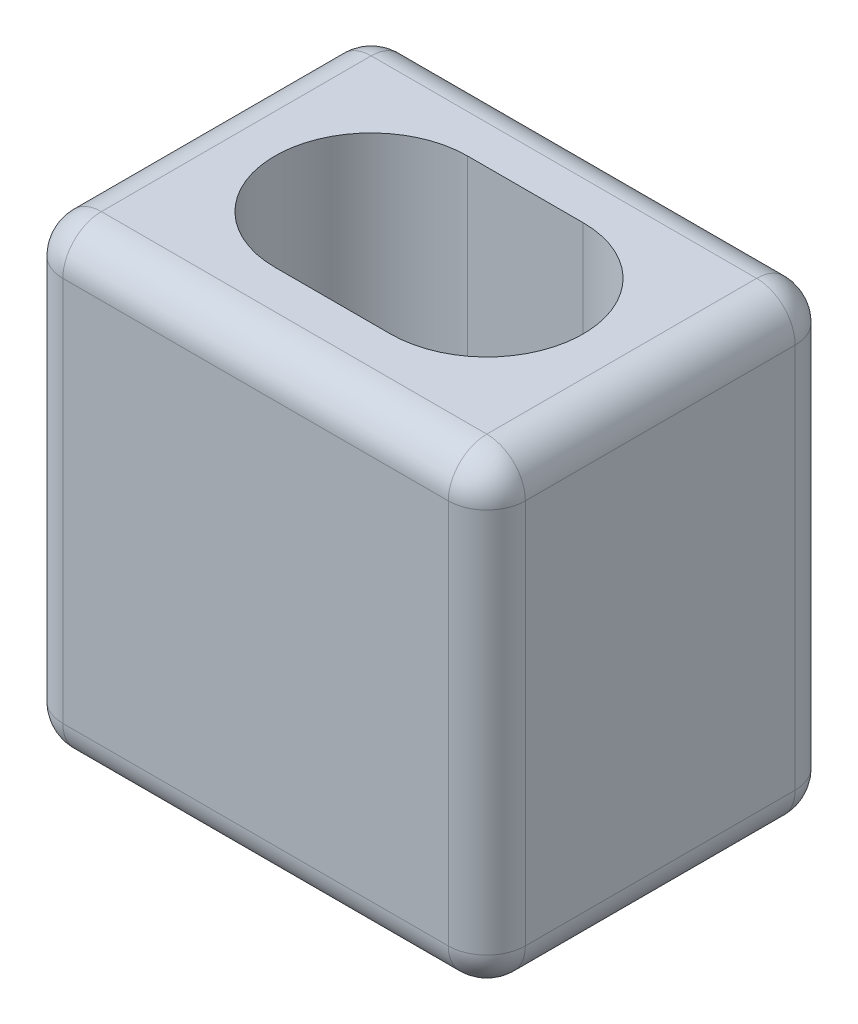
ISO-10303-21;
HEADER;
FILE_DESCRIPTION(('STEP AP214'),'2;1');
FILE_NAME('part.step','',(''),(''),'','','');
FILE_SCHEMA(('AUTOMOTIVE_DESIGN { 1 0 10303 214 1 1 1 1 }'));
ENDSEC;
DATA;
#1=APPLICATION_CONTEXT('core data for automotive mechanical design processes');
#2=APPLICATION_PROTOCOL_DEFINITION('international standard','automotive_design',2000,#1);
#3=PRODUCT_CONTEXT('',#1,'mechanical');
#4=PRODUCT('Part','Part','',(#3));
#5=PRODUCT_RELATED_PRODUCT_CATEGORY('part','',(#4));
#6=PRODUCT_DEFINITION_FORMATION('','',#4);
#7=PRODUCT_DEFINITION_CONTEXT('part definition',#1,'design');
#8=PRODUCT_DEFINITION('design','',#6,#7);
#9=PRODUCT_DEFINITION_SHAPE('','',#8);
#10=(LENGTH_UNIT() NAMED_UNIT(*) SI_UNIT(.MILLI.,.METRE.));
#11=(NAMED_UNIT(*) PLANE_ANGLE_UNIT() SI_UNIT($,.RADIAN.));
#12=(NAMED_UNIT(*) SI_UNIT($,.STERADIAN.) SOLID_ANGLE_UNIT());
#13=UNCERTAINTY_MEASURE_WITH_UNIT(LENGTH_MEASURE(1.E-05),#10,'distance_accuracy_value','');
#14=(GEOMETRIC_REPRESENTATION_CONTEXT(3) GLOBAL_UNCERTAINTY_ASSIGNED_CONTEXT((#13)) GLOBAL_UNIT_ASSIGNED_CONTEXT((#10,
#11,#12)) REPRESENTATION_CONTEXT('',''));
#15=CARTESIAN_POINT('',(0.,0.,0.));
#16=DIRECTION('',(0.,0.,1.));
#17=DIRECTION('',(1.,0.,0.));
#18=AXIS2_PLACEMENT_3D('',#15,#16,#17);
#19=CARTESIAN_POINT('',(0.,152.4,0.));
#20=DIRECTION('',(0.,-1.,0.));
#21=DIRECTION('',(0.,0.,-1.));
#22=AXIS2_PLACEMENT_3D('',#19,#20,#21);
#23=PLANE('',#22);
#24=DIRECTION('',(0.,0.,-1.));
#25=VECTOR('',#24,1.);
#26=CARTESIAN_POINT('',(63.5,152.4,0.));
#27=LINE('',#26,#25);
#28=CARTESIAN_POINT('',(63.5,152.4,44.45));
#29=VERTEX_POINT('',#28);
#30=CARTESIAN_POINT('',(63.5,152.4,-44.45));
#31=VERTEX_POINT('',#30);
#32=EDGE_CURVE('E211',#29,#31,#27,.T.);
#33=ORIENTED_EDGE('',*,*,#32,.T.);
#34=DIRECTION('',(-1.,0.,0.));
#35=VECTOR('',#34,1.);
#36=CARTESIAN_POINT('',(0.,152.4,-44.45));
#37=LINE('',#36,#35);
#38=CARTESIAN_POINT('',(-63.5,152.4,-44.45));
#39=VERTEX_POINT('',#38);
#40=EDGE_CURVE('E218',#31,#39,#37,.T.);
#41=ORIENTED_EDGE('',*,*,#40,.T.);
#42=DIRECTION('',(0.,0.,1.));
#43=VECTOR('',#42,1.);
#44=CARTESIAN_POINT('',(-63.5,152.4,0.));
#45=LINE('',#44,#43);
#46=CARTESIAN_POINT('',(-63.5,152.4,44.45));
#47=VERTEX_POINT('',#46);
#48=EDGE_CURVE('E214',#39,#47,#45,.T.);
#49=ORIENTED_EDGE('',*,*,#48,.T.);
#50=DIRECTION('',(1.,0.,0.));
#51=VECTOR('',#50,1.);
#52=CARTESIAN_POINT('',(0.,152.4,44.45));
#53=LINE('',#52,#51);
#54=EDGE_CURVE('E176',#47,#29,#53,.T.);
#55=ORIENTED_EDGE('',*,*,#54,.T.);
#56=EDGE_LOOP('',(#33,#41,#49,#55));
#57=FACE_BOUND('',#56,.T.);
#58=CARTESIAN_POINT('',(-19.05,152.4,0.));
#59=DIRECTION('',(0.,1.,0.));
#60=DIRECTION('',(0.,0.,1.));
#61=AXIS2_PLACEMENT_3D('',#58,#59,#60);
#62=CIRCLE('',#61,31.75);
#63=CARTESIAN_POINT('',(-19.05,152.4,-31.75));
#64=VERTEX_POINT('',#63);
#65=CARTESIAN_POINT('',(-19.05,152.4,31.75));
#66=VERTEX_POINT('',#65);
#67=EDGE_CURVE('E156',#64,#66,#62,.T.);
#68=ORIENTED_EDGE('',*,*,#67,.F.);
#69=DIRECTION('',(-1.,0.,0.));
#70=VECTOR('',#69,1.);
#71=CARTESIAN_POINT('',(-19.05,152.4,-31.75));
#72=LINE('',#71,#70);
#73=CARTESIAN_POINT('',(19.05,152.4,-31.75));
#74=VERTEX_POINT('',#73);
#75=EDGE_CURVE('E185',#74,#64,#72,.T.);
#76=ORIENTED_EDGE('',*,*,#75,.F.);
#77=CARTESIAN_POINT('',(19.05,152.4,0.));
#78=DIRECTION('',(0.,1.,0.));
#79=DIRECTION('',(0.,0.,1.));
#80=AXIS2_PLACEMENT_3D('',#77,#78,#79);
#81=CIRCLE('',#80,31.75);
#82=CARTESIAN_POINT('',(19.05,152.4,31.75));
#83=VERTEX_POINT('',#82);
#84=EDGE_CURVE('E181',#83,#74,#81,.T.);
#85=ORIENTED_EDGE('',*,*,#84,.F.);
#86=DIRECTION('',(1.,0.,0.));
#87=VECTOR('',#86,1.);
#88=CARTESIAN_POINT('',(-19.05,152.4,31.75));
#89=LINE('',#88,#87);
#90=EDGE_CURVE('E167',#66,#83,#89,.T.);
#91=ORIENTED_EDGE('',*,*,#90,.F.);
#92=EDGE_LOOP('',(#68,#76,#85,#91));
#93=FACE_BOUND('',#92,.T.);
#94=ADVANCED_FACE('F41',(#57,#93),#23,.F.);
#95=CARTESIAN_POINT('',(0.,0.,0.));
#96=DIRECTION('',(0.,-1.,0.));
#97=DIRECTION('',(0.,0.,-1.));
#98=AXIS2_PLACEMENT_3D('',#95,#96,#97);
#99=PLANE('',#98);
#100=DIRECTION('',(0.,0.,1.));
#101=VECTOR('',#100,1.);
#102=CARTESIAN_POINT('',(-63.5,0.,-57.15));
#103=LINE('',#102,#101);
#104=CARTESIAN_POINT('',(-63.5,0.,44.45));
#105=VERTEX_POINT('',#104);
#106=CARTESIAN_POINT('',(-63.5,0.,-44.45));
#107=VERTEX_POINT('',#106);
#108=EDGE_CURVE('E250',#105,#107,#103,.F.);
#109=ORIENTED_EDGE('',*,*,#108,.T.);
#110=DIRECTION('',(-1.,0.,0.));
#111=VECTOR('',#110,1.);
#112=CARTESIAN_POINT('',(76.2,0.,-44.45));
#113=LINE('',#112,#111);
#114=CARTESIAN_POINT('',(63.5,0.,-44.45));
#115=VERTEX_POINT('',#114);
#116=EDGE_CURVE('E257',#107,#115,#113,.F.);
#117=ORIENTED_EDGE('',*,*,#116,.T.);
#118=DIRECTION('',(0.,0.,-1.));
#119=VECTOR('',#118,1.);
#120=CARTESIAN_POINT('',(63.5,0.,57.15));
#121=LINE('',#120,#119);
#122=CARTESIAN_POINT('',(63.5,0.,44.45));
#123=VERTEX_POINT('',#122);
#124=EDGE_CURVE('E253',#115,#123,#121,.F.);
#125=ORIENTED_EDGE('',*,*,#124,.T.);
#126=DIRECTION('',(1.,0.,0.));
#127=VECTOR('',#126,1.);
#128=CARTESIAN_POINT('',(-76.2,0.,44.45));
#129=LINE('',#128,#127);
#130=EDGE_CURVE('E247',#123,#105,#129,.F.);
#131=ORIENTED_EDGE('',*,*,#130,.T.);
#132=EDGE_LOOP('',(#109,#117,#125,#131));
#133=FACE_BOUND('',#132,.T.);
#134=DIRECTION('',(-1.,0.,0.));
#135=VECTOR('',#134,1.);
#136=CARTESIAN_POINT('',(-19.05,0.,-31.75));
#137=LINE('',#136,#135);
#138=CARTESIAN_POINT('',(19.05,0.,-31.75));
#139=VERTEX_POINT('',#138);
#140=CARTESIAN_POINT('',(-19.05,0.,-31.75));
#141=VERTEX_POINT('',#140);
#142=EDGE_CURVE('E168',#139,#141,#137,.T.);
#143=ORIENTED_EDGE('',*,*,#142,.T.);
#144=CARTESIAN_POINT('',(-19.05,0.,0.));
#145=DIRECTION('',(0.,1.,0.));
#146=DIRECTION('',(0.,0.,1.));
#147=AXIS2_PLACEMENT_3D('',#144,#145,#146);
#148=CIRCLE('',#147,31.75);
#149=CARTESIAN_POINT('',(-19.05,0.,31.75));
#150=VERTEX_POINT('',#149);
#151=EDGE_CURVE('E190',#141,#150,#148,.T.);
#152=ORIENTED_EDGE('',*,*,#151,.T.);
#153=DIRECTION('',(1.,0.,0.));
#154=VECTOR('',#153,1.);
#155=CARTESIAN_POINT('',(-19.05,0.,31.75));
#156=LINE('',#155,#154);
#157=CARTESIAN_POINT('',(19.05,0.,31.75));
#158=VERTEX_POINT('',#157);
#159=EDGE_CURVE('E174',#150,#158,#156,.T.);
#160=ORIENTED_EDGE('',*,*,#159,.T.);
#161=CARTESIAN_POINT('',(19.05,0.,0.));
#162=DIRECTION('',(0.,1.,0.));
#163=DIRECTION('',(0.,0.,1.));
#164=AXIS2_PLACEMENT_3D('',#161,#162,#163);
#165=CIRCLE('',#164,31.75);
#166=EDGE_CURVE('E195',#158,#139,#165,.T.);
#167=ORIENTED_EDGE('',*,*,#166,.T.);
#168=EDGE_LOOP('',(#143,#152,#160,#167));
#169=FACE_BOUND('',#168,.T.);
#170=ADVANCED_FACE('F409',(#133,#169),#99,.T.);
#171=CARTESIAN_POINT('',(76.2,152.4,57.15));
#172=DIRECTION('',(-1.,0.,0.));
#173=DIRECTION('',(0.,0.,1.));
#174=AXIS2_PLACEMENT_3D('',#171,#172,#173);
#175=PLANE('',#174);
#176=DIRECTION('',(0.,0.,-1.));
#177=VECTOR('',#176,1.);
#178=CARTESIAN_POINT('',(76.2,12.7,-57.15));
#179=LINE('',#178,#177);
#180=CARTESIAN_POINT('',(76.2,12.7,44.45));
#181=VERTEX_POINT('',#180);
#182=CARTESIAN_POINT('',(76.2,12.7,-44.45));
#183=VERTEX_POINT('',#182);
#184=EDGE_CURVE('E237',#181,#183,#179,.T.);
#185=ORIENTED_EDGE('',*,*,#184,.T.);
#186=DIRECTION('',(0.,-1.,0.));
#187=VECTOR('',#186,1.);
#188=CARTESIAN_POINT('',(76.2,152.4,-44.45));
#189=LINE('',#188,#187);
#190=CARTESIAN_POINT('',(76.2,139.7,-44.45));
#191=VERTEX_POINT('',#190);
#192=EDGE_CURVE('E244',#183,#191,#189,.F.);
#193=ORIENTED_EDGE('',*,*,#192,.T.);
#194=DIRECTION('',(0.,0.,-1.));
#195=VECTOR('',#194,1.);
#196=CARTESIAN_POINT('',(76.2,139.7,57.15));
#197=LINE('',#196,#195);
#198=CARTESIAN_POINT('',(76.2,139.7,44.45));
#199=VERTEX_POINT('',#198);
#200=EDGE_CURVE('E240',#191,#199,#197,.F.);
#201=ORIENTED_EDGE('',*,*,#200,.T.);
#202=DIRECTION('',(0.,-1.,0.));
#203=VECTOR('',#202,1.);
#204=CARTESIAN_POINT('',(76.2,152.4,44.45));
#205=LINE('',#204,#203);
#206=EDGE_CURVE('E234',#199,#181,#205,.T.);
#207=ORIENTED_EDGE('',*,*,#206,.T.);
#208=EDGE_LOOP('',(#185,#193,#201,#207));
#209=FACE_BOUND('',#208,.T.);
#210=ADVANCED_FACE('F396',(#209),#175,.F.);
#211=CARTESIAN_POINT('',(-76.2,152.4,-57.15));
#212=DIRECTION('',(0.,0.,1.));
#213=DIRECTION('',(1.,0.,0.));
#214=AXIS2_PLACEMENT_3D('',#211,#212,#213);
#215=PLANE('',#214);
#216=DIRECTION('',(-1.,0.,0.));
#217=VECTOR('',#216,1.);
#218=CARTESIAN_POINT('',(-76.2,12.7,-57.15));
#219=LINE('',#218,#217);
#220=CARTESIAN_POINT('',(63.5,12.7,-57.15));
#221=VERTEX_POINT('',#220);
#222=CARTESIAN_POINT('',(-63.5,12.7,-57.15));
#223=VERTEX_POINT('',#222);
#224=EDGE_CURVE('E266',#221,#223,#219,.T.);
#225=ORIENTED_EDGE('',*,*,#224,.T.);
#226=DIRECTION('',(0.,-1.,0.));
#227=VECTOR('',#226,1.);
#228=CARTESIAN_POINT('',(-63.5,152.4,-57.15));
#229=LINE('',#228,#227);
#230=CARTESIAN_POINT('',(-63.5,139.7,-57.15));
#231=VERTEX_POINT('',#230);
#232=EDGE_CURVE('E269',#223,#231,#229,.F.);
#233=ORIENTED_EDGE('',*,*,#232,.T.);
#234=DIRECTION('',(-1.,0.,0.));
#235=VECTOR('',#234,1.);
#236=CARTESIAN_POINT('',(-76.2,139.7,-57.15));
#237=LINE('',#236,#235);
#238=CARTESIAN_POINT('',(63.5,139.7,-57.15));
#239=VERTEX_POINT('',#238);
#240=EDGE_CURVE('E260',#231,#239,#237,.F.);
#241=ORIENTED_EDGE('',*,*,#240,.T.);
#242=DIRECTION('',(0.,-1.,0.));
#243=VECTOR('',#242,1.);
#244=CARTESIAN_POINT('',(63.5,152.4,-57.15));
#245=LINE('',#244,#243);
#246=EDGE_CURVE('E263',#239,#221,#245,.T.);
#247=ORIENTED_EDGE('',*,*,#246,.T.);
#248=EDGE_LOOP('',(#225,#233,#241,#247));
#249=FACE_BOUND('',#248,.T.);
#250=ADVANCED_FACE('F387',(#249),#215,.F.);
#251=CARTESIAN_POINT('',(-76.2,152.4,57.15));
#252=DIRECTION('',(1.,0.,0.));
#253=DIRECTION('',(0.,0.,-1.));
#254=AXIS2_PLACEMENT_3D('',#251,#252,#253);
#255=PLANE('',#254);
#256=DIRECTION('',(0.,0.,1.));
#257=VECTOR('',#256,1.);
#258=CARTESIAN_POINT('',(-76.2,139.7,57.15));
#259=LINE('',#258,#257);
#260=CARTESIAN_POINT('',(-76.2,139.7,44.45));
#261=VERTEX_POINT('',#260);
#262=CARTESIAN_POINT('',(-76.2,139.7,-44.45));
#263=VERTEX_POINT('',#262);
#264=EDGE_CURVE('E227',#261,#263,#259,.F.);
#265=ORIENTED_EDGE('',*,*,#264,.T.);
#266=DIRECTION('',(0.,-1.,0.));
#267=VECTOR('',#266,1.);
#268=CARTESIAN_POINT('',(-76.2,152.4,-44.45));
#269=LINE('',#268,#267);
#270=CARTESIAN_POINT('',(-76.2,12.7,-44.45));
#271=VERTEX_POINT('',#270);
#272=EDGE_CURVE('E231',#263,#271,#269,.T.);
#273=ORIENTED_EDGE('',*,*,#272,.T.);
#274=DIRECTION('',(0.,0.,1.));
#275=VECTOR('',#274,1.);
#276=CARTESIAN_POINT('',(-76.2,12.7,57.15));
#277=LINE('',#276,#275);
#278=CARTESIAN_POINT('',(-76.2,12.7,44.45));
#279=VERTEX_POINT('',#278);
#280=EDGE_CURVE('E224',#271,#279,#277,.T.);
#281=ORIENTED_EDGE('',*,*,#280,.T.);
#282=DIRECTION('',(0.,-1.,0.));
#283=VECTOR('',#282,1.);
#284=CARTESIAN_POINT('',(-76.2,152.4,44.45));
#285=LINE('',#284,#283);
#286=EDGE_CURVE('E221',#279,#261,#285,.F.);
#287=ORIENTED_EDGE('',*,*,#286,.T.);
#288=EDGE_LOOP('',(#265,#273,#281,#287));
#289=FACE_BOUND('',#288,.T.);
#290=ADVANCED_FACE('F429',(#289),#255,.F.);
#291=CARTESIAN_POINT('',(-76.2,152.4,57.15));
#292=DIRECTION('',(0.,0.,-1.));
#293=DIRECTION('',(-1.,0.,0.));
#294=AXIS2_PLACEMENT_3D('',#291,#292,#293);
#295=PLANE('',#294);
#296=DIRECTION('',(0.,-1.,0.));
#297=VECTOR('',#296,1.);
#298=CARTESIAN_POINT('',(63.5,152.4,57.15));
#299=LINE('',#298,#297);
#300=CARTESIAN_POINT('',(63.5,12.7,57.15));
#301=VERTEX_POINT('',#300);
#302=CARTESIAN_POINT('',(63.5,139.7,57.15));
#303=VERTEX_POINT('',#302);
#304=EDGE_CURVE('E51',#301,#303,#299,.F.);
#305=ORIENTED_EDGE('',*,*,#304,.T.);
#306=DIRECTION('',(1.,0.,0.));
#307=VECTOR('',#306,1.);
#308=CARTESIAN_POINT('',(-76.2,139.7,57.15));
#309=LINE('',#308,#307);
#310=CARTESIAN_POINT('',(-63.5,139.7,57.15));
#311=VERTEX_POINT('',#310);
#312=EDGE_CURVE('E11',#303,#311,#309,.F.);
#313=ORIENTED_EDGE('',*,*,#312,.T.);
#314=DIRECTION('',(0.,-1.,0.));
#315=VECTOR('',#314,1.);
#316=CARTESIAN_POINT('',(-63.5,152.4,57.15));
#317=LINE('',#316,#315);
#318=CARTESIAN_POINT('',(-63.5,12.7,57.15));
#319=VERTEX_POINT('',#318);
#320=EDGE_CURVE('E273',#311,#319,#317,.T.);
#321=ORIENTED_EDGE('',*,*,#320,.T.);
#322=DIRECTION('',(1.,0.,0.));
#323=VECTOR('',#322,1.);
#324=CARTESIAN_POINT('',(76.2,12.7,57.15));
#325=LINE('',#324,#323);
#326=EDGE_CURVE('E62',#319,#301,#325,.T.);
#327=ORIENTED_EDGE('',*,*,#326,.T.);
#328=EDGE_LOOP('',(#305,#313,#321,#327));
#329=FACE_BOUND('',#328,.T.);
#330=ADVANCED_FACE('F463',(#329),#295,.F.);
#331=CARTESIAN_POINT('',(-19.05,152.4,0.));
#332=DIRECTION('',(0.,-1.,0.));
#333=DIRECTION('',(0.,0.,-1.));
#334=AXIS2_PLACEMENT_3D('',#331,#332,#333);
#335=CYLINDRICAL_SURFACE('',#334,31.75);
#336=ORIENTED_EDGE('',*,*,#151,.F.);
#337=DIRECTION('',(0.,-1.,0.));
#338=VECTOR('',#337,1.);
#339=CARTESIAN_POINT('',(-19.05,152.4,-31.75));
#340=LINE('',#339,#338);
#341=EDGE_CURVE('E162',#64,#141,#340,.T.);
#342=ORIENTED_EDGE('',*,*,#341,.F.);
#343=ORIENTED_EDGE('',*,*,#67,.T.);
#344=DIRECTION('',(0.,-1.,0.));
#345=VECTOR('',#344,1.);
#346=CARTESIAN_POINT('',(-19.05,152.4,31.75));
#347=LINE('',#346,#345);
#348=EDGE_CURVE('E159',#66,#150,#347,.T.);
#349=ORIENTED_EDGE('',*,*,#348,.T.);
#350=EDGE_LOOP('',(#336,#342,#343,#349));
#351=FACE_BOUND('',#350,.T.);
#352=ADVANCED_FACE('F158',(#351),#335,.F.);
#353=CARTESIAN_POINT('',(-19.05,152.4,31.75));
#354=DIRECTION('',(0.,0.,-1.));
#355=DIRECTION('',(-1.,0.,0.));
#356=AXIS2_PLACEMENT_3D('',#353,#354,#355);
#357=PLANE('',#356);
#358=ORIENTED_EDGE('',*,*,#159,.F.);
#359=ORIENTED_EDGE('',*,*,#348,.F.);
#360=ORIENTED_EDGE('',*,*,#90,.T.);
#361=DIRECTION('',(0.,-1.,0.));
#362=VECTOR('',#361,1.);
#363=CARTESIAN_POINT('',(19.05,152.4,31.75));
#364=LINE('',#363,#362);
#365=EDGE_CURVE('E177',#83,#158,#364,.T.);
#366=ORIENTED_EDGE('',*,*,#365,.T.);
#367=EDGE_LOOP('',(#358,#359,#360,#366));
#368=FACE_BOUND('',#367,.T.);
#369=ADVANCED_FACE('F171',(#368),#357,.T.);
#370=CARTESIAN_POINT('',(19.05,152.4,0.));
#371=DIRECTION('',(0.,-1.,0.));
#372=DIRECTION('',(0.,0.,-1.));
#373=AXIS2_PLACEMENT_3D('',#370,#371,#372);
#374=CYLINDRICAL_SURFACE('',#373,31.75);
#375=ORIENTED_EDGE('',*,*,#166,.F.);
#376=ORIENTED_EDGE('',*,*,#365,.F.);
#377=ORIENTED_EDGE('',*,*,#84,.T.);
#378=DIRECTION('',(0.,-1.,0.));
#379=VECTOR('',#378,1.);
#380=CARTESIAN_POINT('',(19.05,152.4,-31.75));
#381=LINE('',#380,#379);
#382=EDGE_CURVE('E204',#74,#139,#381,.T.);
#383=ORIENTED_EDGE('',*,*,#382,.T.);
#384=EDGE_LOOP('',(#375,#376,#377,#383));
#385=FACE_BOUND('',#384,.T.);
#386=ADVANCED_FACE('F627',(#385),#374,.F.);
#387=CARTESIAN_POINT('',(-19.05,152.4,-31.75));
#388=DIRECTION('',(0.,0.,1.));
#389=DIRECTION('',(1.,0.,0.));
#390=AXIS2_PLACEMENT_3D('',#387,#388,#389);
#391=PLANE('',#390);
#392=ORIENTED_EDGE('',*,*,#142,.F.);
#393=ORIENTED_EDGE('',*,*,#382,.F.);
#394=ORIENTED_EDGE('',*,*,#75,.T.);
#395=ORIENTED_EDGE('',*,*,#341,.T.);
#396=EDGE_LOOP('',(#392,#393,#394,#395));
#397=FACE_BOUND('',#396,.T.);
#398=ADVANCED_FACE('F619',(#397),#391,.T.);
#399=CARTESIAN_POINT('',(63.5,12.7,57.15));
#400=DIRECTION('',(0.,0.,1.));
#401=DIRECTION('',(1.,0.,0.));
#402=AXIS2_PLACEMENT_3D('',#399,#400,#401);
#403=CYLINDRICAL_SURFACE('',#402,12.7);
#404=CARTESIAN_POINT('',(63.5,12.7,-44.45));
#405=DIRECTION('',(0.,0.,-1.));
#406=DIRECTION('',(-1.,0.,0.));
#407=AXIS2_PLACEMENT_3D('',#404,#405,#406);
#408=CIRCLE('',#407,12.7);
#409=EDGE_CURVE('E45',#183,#115,#408,.T.);
#410=ORIENTED_EDGE('',*,*,#409,.F.);
#411=ORIENTED_EDGE('',*,*,#184,.F.);
#412=CARTESIAN_POINT('',(63.5,12.7,44.45));
#413=DIRECTION('',(0.,0.,1.));
#414=DIRECTION('',(1.,0.,0.));
#415=AXIS2_PLACEMENT_3D('',#412,#413,#414);
#416=CIRCLE('',#415,12.7);
#417=EDGE_CURVE('E361',#123,#181,#416,.T.);
#418=ORIENTED_EDGE('',*,*,#417,.F.);
#419=ORIENTED_EDGE('',*,*,#124,.F.);
#420=EDGE_LOOP('',(#410,#411,#418,#419));
#421=FACE_BOUND('',#420,.T.);
#422=ADVANCED_FACE('F43',(#421),#403,.T.);
#423=CARTESIAN_POINT('',(63.5,12.7,-44.45));
#424=DIRECTION('',(0.,-1.,0.));
#425=DIRECTION('',(0.,0.,-1.));
#426=AXIS2_PLACEMENT_3D('',#423,#424,#425);
#427=SPHERICAL_SURFACE('',#426,12.7);
#428=CARTESIAN_POINT('',(63.5,12.7,-44.45));
#429=DIRECTION('',(0.,-1.,0.));
#430=DIRECTION('',(0.,0.,-1.));
#431=AXIS2_PLACEMENT_3D('',#428,#429,#430);
#432=CIRCLE('',#431,12.7);
#433=EDGE_CURVE('E354',#183,#221,#432,.F.);
#434=ORIENTED_EDGE('',*,*,#433,.F.);
#435=ORIENTED_EDGE('',*,*,#409,.T.);
#436=CARTESIAN_POINT('',(63.5,12.7,-44.45));
#437=DIRECTION('',(1.,0.,0.));
#438=DIRECTION('',(0.,0.,-1.));
#439=AXIS2_PLACEMENT_3D('',#436,#437,#438);
#440=CIRCLE('',#439,12.7);
#441=EDGE_CURVE('E358',#221,#115,#440,.F.);
#442=ORIENTED_EDGE('',*,*,#441,.F.);
#443=EDGE_LOOP('',(#434,#435,#442));
#444=FACE_BOUND('',#443,.T.);
#445=ADVANCED_FACE('F374',(#444),#427,.T.);
#446=CARTESIAN_POINT('',(63.5,12.7,44.45));
#447=DIRECTION('',(1.,0.,0.));
#448=DIRECTION('',(0.,1.,0.));
#449=AXIS2_PLACEMENT_3D('',#446,#447,#448);
#450=SPHERICAL_SURFACE('',#449,12.7);
#451=CARTESIAN_POINT('',(63.5,12.7,44.45));
#452=DIRECTION('',(1.,0.,0.));
#453=DIRECTION('',(0.,0.,-1.));
#454=AXIS2_PLACEMENT_3D('',#451,#452,#453);
#455=CIRCLE('',#454,12.7);
#456=EDGE_CURVE('E347',#123,#301,#455,.F.);
#457=ORIENTED_EDGE('',*,*,#456,.F.);
#458=ORIENTED_EDGE('',*,*,#417,.T.);
#459=CARTESIAN_POINT('',(63.5,12.7,44.45));
#460=DIRECTION('',(0.,-1.,0.));
#461=DIRECTION('',(0.,0.,-1.));
#462=AXIS2_PLACEMENT_3D('',#459,#460,#461);
#463=CIRCLE('',#462,12.7);
#464=EDGE_CURVE('E350',#301,#181,#463,.F.);
#465=ORIENTED_EDGE('',*,*,#464,.F.);
#466=EDGE_LOOP('',(#457,#458,#465));
#467=FACE_BOUND('',#466,.T.);
#468=ADVANCED_FACE('F598',(#467),#450,.T.);
#469=CARTESIAN_POINT('',(-76.2,12.7,-44.45));
#470=DIRECTION('',(1.,0.,0.));
#471=DIRECTION('',(0.,0.,-1.));
#472=AXIS2_PLACEMENT_3D('',#469,#470,#471);
#473=CYLINDRICAL_SURFACE('',#472,12.7);
#474=ORIENTED_EDGE('',*,*,#441,.T.);
#475=ORIENTED_EDGE('',*,*,#116,.F.);
#476=CARTESIAN_POINT('',(-63.5,12.7,-44.45));
#477=DIRECTION('',(-1.,0.,0.));
#478=DIRECTION('',(0.,0.,1.));
#479=AXIS2_PLACEMENT_3D('',#476,#477,#478);
#480=CIRCLE('',#479,12.7);
#481=EDGE_CURVE('E339',#223,#107,#480,.T.);
#482=ORIENTED_EDGE('',*,*,#481,.F.);
#483=ORIENTED_EDGE('',*,*,#224,.F.);
#484=EDGE_LOOP('',(#474,#475,#482,#483));
#485=FACE_BOUND('',#484,.T.);
#486=ADVANCED_FACE('F382',(#485),#473,.T.);
#487=CARTESIAN_POINT('',(63.5,152.4,-44.45));
#488=DIRECTION('',(0.,-1.,0.));
#489=DIRECTION('',(0.,0.,-1.));
#490=AXIS2_PLACEMENT_3D('',#487,#488,#489);
#491=CYLINDRICAL_SURFACE('',#490,12.7);
#492=ORIENTED_EDGE('',*,*,#433,.T.);
#493=ORIENTED_EDGE('',*,*,#246,.F.);
#494=CARTESIAN_POINT('',(63.5,139.7,-44.45));
#495=DIRECTION('',(0.,1.,0.));
#496=DIRECTION('',(0.,0.,1.));
#497=AXIS2_PLACEMENT_3D('',#494,#495,#496);
#498=CIRCLE('',#497,12.7);
#499=EDGE_CURVE('E335',#191,#239,#498,.T.);
#500=ORIENTED_EDGE('',*,*,#499,.F.);
#501=ORIENTED_EDGE('',*,*,#192,.F.);
#502=EDGE_LOOP('',(#492,#493,#500,#501));
#503=FACE_BOUND('',#502,.T.);
#504=ADVANCED_FACE('F393',(#503),#491,.T.);
#505=CARTESIAN_POINT('',(63.5,139.7,0.));
#506=DIRECTION('',(0.,0.,-1.));
#507=DIRECTION('',(-1.,0.,0.));
#508=AXIS2_PLACEMENT_3D('',#505,#506,#507);
#509=CYLINDRICAL_SURFACE('',#508,12.7);
#510=CARTESIAN_POINT('',(63.5,139.7,44.45));
#511=DIRECTION('',(0.,0.,1.));
#512=DIRECTION('',(1.,0.,0.));
#513=AXIS2_PLACEMENT_3D('',#510,#511,#512);
#514=CIRCLE('',#513,12.7);
#515=EDGE_CURVE('E327',#199,#29,#514,.T.);
#516=ORIENTED_EDGE('',*,*,#515,.F.);
#517=ORIENTED_EDGE('',*,*,#200,.F.);
#518=CARTESIAN_POINT('',(63.5,139.7,-44.45));
#519=DIRECTION('',(0.,0.,-1.));
#520=DIRECTION('',(-1.,0.,0.));
#521=AXIS2_PLACEMENT_3D('',#518,#519,#520);
#522=CIRCLE('',#521,12.7);
#523=EDGE_CURVE('E331',#31,#191,#522,.T.);
#524=ORIENTED_EDGE('',*,*,#523,.F.);
#525=ORIENTED_EDGE('',*,*,#32,.F.);
#526=EDGE_LOOP('',(#516,#517,#524,#525));
#527=FACE_BOUND('',#526,.T.);
#528=ADVANCED_FACE('F400',(#527),#509,.T.);
#529=CARTESIAN_POINT('',(63.5,152.4,44.45));
#530=DIRECTION('',(0.,-1.,0.));
#531=DIRECTION('',(0.,0.,-1.));
#532=AXIS2_PLACEMENT_3D('',#529,#530,#531);
#533=CYLINDRICAL_SURFACE('',#532,12.7);
#534=ORIENTED_EDGE('',*,*,#464,.T.);
#535=ORIENTED_EDGE('',*,*,#206,.F.);
#536=CARTESIAN_POINT('',(63.5,139.7,44.45));
#537=DIRECTION('',(0.,1.,0.));
#538=DIRECTION('',(0.,0.,1.));
#539=AXIS2_PLACEMENT_3D('',#536,#537,#538);
#540=CIRCLE('',#539,12.7);
#541=EDGE_CURVE('E324',#303,#199,#540,.T.);
#542=ORIENTED_EDGE('',*,*,#541,.F.);
#543=ORIENTED_EDGE('',*,*,#304,.F.);
#544=EDGE_LOOP('',(#534,#535,#542,#543));
#545=FACE_BOUND('',#544,.T.);
#546=ADVANCED_FACE('F407',(#545),#533,.T.);
#547=CARTESIAN_POINT('',(-76.2,12.7,44.45));
#548=DIRECTION('',(-1.,0.,0.));
#549=DIRECTION('',(0.,0.,1.));
#550=AXIS2_PLACEMENT_3D('',#547,#548,#549);
#551=CYLINDRICAL_SURFACE('',#550,12.7);
#552=ORIENTED_EDGE('',*,*,#456,.T.);
#553=ORIENTED_EDGE('',*,*,#326,.F.);
#554=CARTESIAN_POINT('',(-63.5,12.7,44.45));
#555=DIRECTION('',(-1.,0.,0.));
#556=DIRECTION('',(0.,0.,1.));
#557=AXIS2_PLACEMENT_3D('',#554,#555,#556);
#558=CIRCLE('',#557,12.7);
#559=EDGE_CURVE('E320',#105,#319,#558,.T.);
#560=ORIENTED_EDGE('',*,*,#559,.F.);
#561=ORIENTED_EDGE('',*,*,#130,.F.);
#562=EDGE_LOOP('',(#552,#553,#560,#561));
#563=FACE_BOUND('',#562,.T.);
#564=ADVANCED_FACE('F419',(#563),#551,.T.);
#565=CARTESIAN_POINT('',(-63.5,12.7,57.15));
#566=DIRECTION('',(0.,0.,-1.));
#567=DIRECTION('',(-1.,0.,0.));
#568=AXIS2_PLACEMENT_3D('',#565,#566,#567);
#569=CYLINDRICAL_SURFACE('',#568,12.7);
#570=CARTESIAN_POINT('',(-63.5,12.7,-44.45));
#571=DIRECTION('',(0.,0.,-1.));
#572=DIRECTION('',(-1.,0.,0.));
#573=AXIS2_PLACEMENT_3D('',#570,#571,#572);
#574=CIRCLE('',#573,12.7);
#575=EDGE_CURVE('E343',#107,#271,#574,.T.);
#576=ORIENTED_EDGE('',*,*,#575,.F.);
#577=ORIENTED_EDGE('',*,*,#108,.F.);
#578=CARTESIAN_POINT('',(-63.5,12.7,44.45));
#579=DIRECTION('',(0.,0.,1.));
#580=DIRECTION('',(1.,0.,0.));
#581=AXIS2_PLACEMENT_3D('',#578,#579,#580);
#582=CIRCLE('',#581,12.7);
#583=EDGE_CURVE('E316',#279,#105,#582,.T.);
#584=ORIENTED_EDGE('',*,*,#583,.F.);
#585=ORIENTED_EDGE('',*,*,#280,.F.);
#586=EDGE_LOOP('',(#576,#577,#584,#585));
#587=FACE_BOUND('',#586,.T.);
#588=ADVANCED_FACE('F415',(#587),#569,.T.);
#589=CARTESIAN_POINT('',(-63.5,12.7,-44.45));
#590=DIRECTION('',(0.,-1.,0.));
#591=DIRECTION('',(0.,0.,-1.));
#592=AXIS2_PLACEMENT_3D('',#589,#590,#591);
#593=SPHERICAL_SURFACE('',#592,12.7);
#594=ORIENTED_EDGE('',*,*,#481,.T.);
#595=ORIENTED_EDGE('',*,*,#575,.T.);
#596=CARTESIAN_POINT('',(-63.5,12.7,-44.45));
#597=DIRECTION('',(0.,-1.,0.));
#598=DIRECTION('',(0.,0.,-1.));
#599=AXIS2_PLACEMENT_3D('',#596,#597,#598);
#600=CIRCLE('',#599,12.7);
#601=EDGE_CURVE('E312',#223,#271,#600,.F.);
#602=ORIENTED_EDGE('',*,*,#601,.F.);
#603=EDGE_LOOP('',(#594,#595,#602));
#604=FACE_BOUND('',#603,.T.);
#605=ADVANCED_FACE('F432',(#604),#593,.T.);
#606=CARTESIAN_POINT('',(63.5,139.7,-44.45));
#607=DIRECTION('',(1.,0.,0.));
#608=DIRECTION('',(0.,0.,-1.));
#609=AXIS2_PLACEMENT_3D('',#606,#607,#608);
#610=SPHERICAL_SURFACE('',#609,12.7);
#611=ORIENTED_EDGE('',*,*,#523,.T.);
#612=ORIENTED_EDGE('',*,*,#499,.T.);
#613=CARTESIAN_POINT('',(63.5,139.7,-44.45));
#614=DIRECTION('',(1.,0.,0.));
#615=DIRECTION('',(0.,1.,0.));
#616=AXIS2_PLACEMENT_3D('',#613,#614,#615);
#617=CIRCLE('',#616,12.7);
#618=EDGE_CURVE('E308',#31,#239,#617,.F.);
#619=ORIENTED_EDGE('',*,*,#618,.F.);
#620=EDGE_LOOP('',(#611,#612,#619));
#621=FACE_BOUND('',#620,.T.);
#622=ADVANCED_FACE('F443',(#621),#610,.T.);
#623=CARTESIAN_POINT('',(63.5,139.7,44.45));
#624=DIRECTION('',(1.,0.,0.));
#625=DIRECTION('',(0.,0.,-1.));
#626=AXIS2_PLACEMENT_3D('',#623,#624,#625);
#627=SPHERICAL_SURFACE('',#626,12.7);
#628=ORIENTED_EDGE('',*,*,#541,.T.);
#629=ORIENTED_EDGE('',*,*,#515,.T.);
#630=CARTESIAN_POINT('',(63.5,139.7,44.45));
#631=DIRECTION('',(1.,0.,0.));
#632=DIRECTION('',(0.,0.,-1.));
#633=AXIS2_PLACEMENT_3D('',#630,#631,#632);
#634=CIRCLE('',#633,12.7);
#635=EDGE_CURVE('E304',#303,#29,#634,.F.);
#636=ORIENTED_EDGE('',*,*,#635,.F.);
#637=EDGE_LOOP('',(#628,#629,#636));
#638=FACE_BOUND('',#637,.T.);
#639=ADVANCED_FACE('F445',(#638),#627,.T.);
#640=CARTESIAN_POINT('',(-63.5,12.7,44.45));
#641=DIRECTION('',(0.,-1.,0.));
#642=DIRECTION('',(0.,0.,-1.));
#643=AXIS2_PLACEMENT_3D('',#640,#641,#642);
#644=SPHERICAL_SURFACE('',#643,12.7);
#645=ORIENTED_EDGE('',*,*,#583,.T.);
#646=ORIENTED_EDGE('',*,*,#559,.T.);
#647=CARTESIAN_POINT('',(-63.5,12.7,44.45));
#648=DIRECTION('',(0.,-1.,0.));
#649=DIRECTION('',(0.,0.,-1.));
#650=AXIS2_PLACEMENT_3D('',#647,#648,#649);
#651=CIRCLE('',#650,12.7);
#652=EDGE_CURVE('E300',#279,#319,#651,.F.);
#653=ORIENTED_EDGE('',*,*,#652,.F.);
#654=EDGE_LOOP('',(#645,#646,#653));
#655=FACE_BOUND('',#654,.T.);
#656=ADVANCED_FACE('F421',(#655),#644,.T.);
#657=CARTESIAN_POINT('',(-63.5,152.4,-44.45));
#658=DIRECTION('',(0.,-1.,0.));
#659=DIRECTION('',(0.,0.,-1.));
#660=AXIS2_PLACEMENT_3D('',#657,#658,#659);
#661=CYLINDRICAL_SURFACE('',#660,12.7);
#662=ORIENTED_EDGE('',*,*,#601,.T.);
#663=ORIENTED_EDGE('',*,*,#272,.F.);
#664=CARTESIAN_POINT('',(-63.5,139.7,-44.45));
#665=DIRECTION('',(0.,1.,0.));
#666=DIRECTION('',(0.,0.,1.));
#667=AXIS2_PLACEMENT_3D('',#664,#665,#666);
#668=CIRCLE('',#667,12.7);
#669=EDGE_CURVE('E296',#231,#263,#668,.T.);
#670=ORIENTED_EDGE('',*,*,#669,.F.);
#671=ORIENTED_EDGE('',*,*,#232,.F.);
#672=EDGE_LOOP('',(#662,#663,#670,#671));
#673=FACE_BOUND('',#672,.T.);
#674=ADVANCED_FACE('F434',(#673),#661,.T.);
#675=CARTESIAN_POINT('',(0.,139.7,-44.45));
#676=DIRECTION('',(-1.,0.,0.));
#677=DIRECTION('',(0.,0.,1.));
#678=AXIS2_PLACEMENT_3D('',#675,#676,#677);
#679=CYLINDRICAL_SURFACE('',#678,12.7);
#680=ORIENTED_EDGE('',*,*,#618,.T.);
#681=ORIENTED_EDGE('',*,*,#240,.F.);
#682=CARTESIAN_POINT('',(-63.5,139.7,-44.45));
#683=DIRECTION('',(-1.,0.,0.));
#684=DIRECTION('',(0.,0.,1.));
#685=AXIS2_PLACEMENT_3D('',#682,#683,#684);
#686=CIRCLE('',#685,12.7);
#687=EDGE_CURVE('E293',#39,#231,#686,.T.);
#688=ORIENTED_EDGE('',*,*,#687,.F.);
#689=ORIENTED_EDGE('',*,*,#40,.F.);
#690=EDGE_LOOP('',(#680,#681,#688,#689));
#691=FACE_BOUND('',#690,.T.);
#692=ADVANCED_FACE('F440',(#691),#679,.T.);
#693=CARTESIAN_POINT('',(0.,139.7,44.45));
#694=DIRECTION('',(1.,0.,0.));
#695=DIRECTION('',(0.,0.,-1.));
#696=AXIS2_PLACEMENT_3D('',#693,#694,#695);
#697=CYLINDRICAL_SURFACE('',#696,12.7);
#698=ORIENTED_EDGE('',*,*,#635,.T.);
#699=ORIENTED_EDGE('',*,*,#54,.F.);
#700=CARTESIAN_POINT('',(-63.5,139.7,44.45));
#701=DIRECTION('',(-1.,0.,0.));
#702=DIRECTION('',(0.,0.,1.));
#703=AXIS2_PLACEMENT_3D('',#700,#701,#702);
#704=CIRCLE('',#703,12.7);
#705=EDGE_CURVE('E289',#311,#47,#704,.T.);
#706=ORIENTED_EDGE('',*,*,#705,.F.);
#707=ORIENTED_EDGE('',*,*,#312,.F.);
#708=EDGE_LOOP('',(#698,#699,#706,#707));
#709=FACE_BOUND('',#708,.T.);
#710=ADVANCED_FACE('F485',(#709),#697,.T.);
#711=CARTESIAN_POINT('',(-63.5,152.4,44.45));
#712=DIRECTION('',(0.,-1.,0.));
#713=DIRECTION('',(0.,0.,-1.));
#714=AXIS2_PLACEMENT_3D('',#711,#712,#713);
#715=CYLINDRICAL_SURFACE('',#714,12.7);
#716=ORIENTED_EDGE('',*,*,#652,.T.);
#717=ORIENTED_EDGE('',*,*,#320,.F.);
#718=CARTESIAN_POINT('',(-63.5,139.7,44.45));
#719=DIRECTION('',(0.,1.,0.));
#720=DIRECTION('',(0.,0.,1.));
#721=AXIS2_PLACEMENT_3D('',#718,#719,#720);
#722=CIRCLE('',#721,12.7);
#723=EDGE_CURVE('E286',#261,#311,#722,.T.);
#724=ORIENTED_EDGE('',*,*,#723,.F.);
#725=ORIENTED_EDGE('',*,*,#286,.F.);
#726=EDGE_LOOP('',(#716,#717,#724,#725));
#727=FACE_BOUND('',#726,.T.);
#728=ADVANCED_FACE('F426',(#727),#715,.T.);
#729=CARTESIAN_POINT('',(-63.5,139.7,-44.45));
#730=DIRECTION('',(0.,0.,-1.));
#731=DIRECTION('',(-1.,0.,0.));
#732=AXIS2_PLACEMENT_3D('',#729,#730,#731);
#733=SPHERICAL_SURFACE('',#732,12.7);
#734=ORIENTED_EDGE('',*,*,#687,.T.);
#735=ORIENTED_EDGE('',*,*,#669,.T.);
#736=CARTESIAN_POINT('',(-63.5,139.7,-44.45));
#737=DIRECTION('',(0.,0.,-1.));
#738=DIRECTION('',(0.,1.,0.));
#739=AXIS2_PLACEMENT_3D('',#736,#737,#738);
#740=CIRCLE('',#739,12.7);
#741=EDGE_CURVE('E283',#39,#263,#740,.F.);
#742=ORIENTED_EDGE('',*,*,#741,.F.);
#743=EDGE_LOOP('',(#734,#735,#742));
#744=FACE_BOUND('',#743,.T.);
#745=ADVANCED_FACE('F479',(#744),#733,.T.);
#746=CARTESIAN_POINT('',(-63.5,139.7,44.45));
#747=DIRECTION('',(0.,0.,1.));
#748=DIRECTION('',(1.,0.,0.));
#749=AXIS2_PLACEMENT_3D('',#746,#747,#748);
#750=SPHERICAL_SURFACE('',#749,12.7);
#751=ORIENTED_EDGE('',*,*,#723,.T.);
#752=ORIENTED_EDGE('',*,*,#705,.T.);
#753=CARTESIAN_POINT('',(-63.5,139.7,44.45));
#754=DIRECTION('',(0.,0.,1.));
#755=DIRECTION('',(1.,0.,0.));
#756=AXIS2_PLACEMENT_3D('',#753,#754,#755);
#757=CIRCLE('',#756,12.7);
#758=EDGE_CURVE('E280',#261,#47,#757,.F.);
#759=ORIENTED_EDGE('',*,*,#758,.F.);
#760=EDGE_LOOP('',(#751,#752,#759));
#761=FACE_BOUND('',#760,.T.);
#762=ADVANCED_FACE('F475',(#761),#750,.T.);
#763=CARTESIAN_POINT('',(-63.5,139.7,0.));
#764=DIRECTION('',(0.,0.,1.));
#765=DIRECTION('',(1.,0.,0.));
#766=AXIS2_PLACEMENT_3D('',#763,#764,#765);
#767=CYLINDRICAL_SURFACE('',#766,12.7);
#768=ORIENTED_EDGE('',*,*,#741,.T.);
#769=ORIENTED_EDGE('',*,*,#264,.F.);
#770=ORIENTED_EDGE('',*,*,#758,.T.);
#771=ORIENTED_EDGE('',*,*,#48,.F.);
#772=EDGE_LOOP('',(#768,#769,#770,#771));
#773=FACE_BOUND('',#772,.T.);
#774=ADVANCED_FACE('F472',(#773),#767,.T.);
#775=CLOSED_SHELL('',(#94,#170,#210,#250,#290,#330,#352,#369,#386,#398,#422,#445,#468,#486,#504,
#528,#546,#564,#588,#605,#622,#639,#656,#674,#692,#710,#728,#745,#762,#774));
#776=MANIFOLD_SOLID_BREP('B2',#775);
#777=ADVANCED_BREP_SHAPE_REPRESENTATION('',(#18,#776),#14);
#778=SHAPE_DEFINITION_REPRESENTATION(#9,#777);
ENDSEC;
END-ISO-10303-21;
